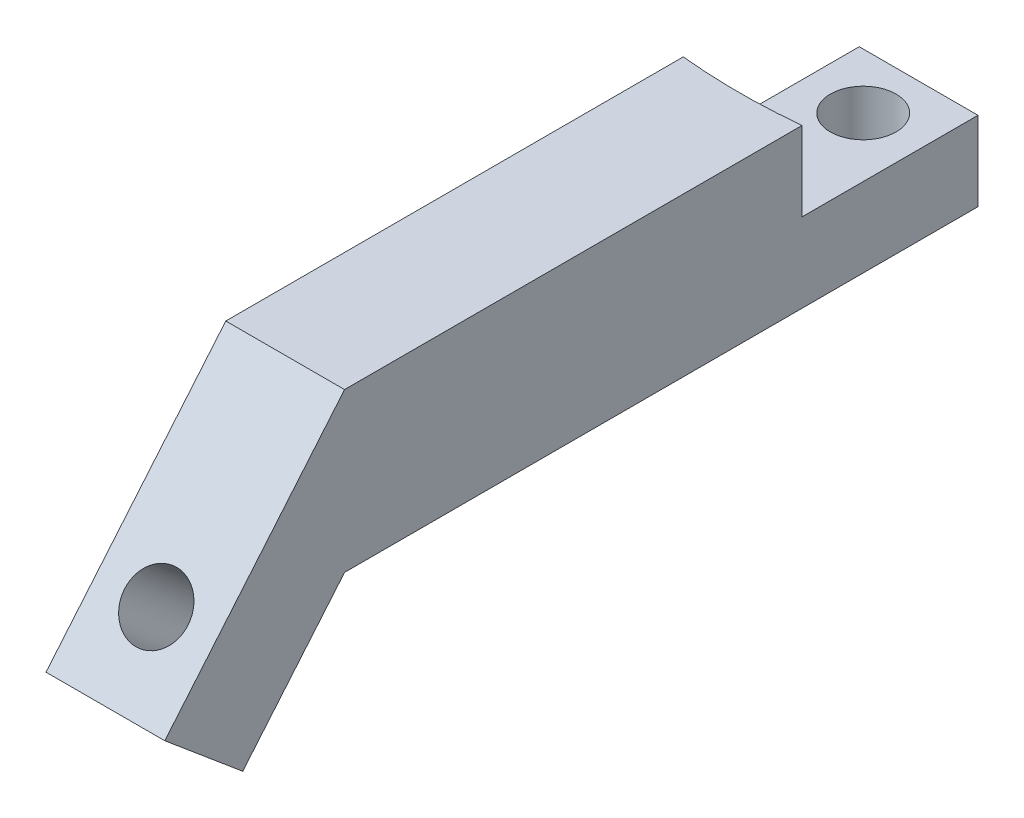
ISO-10303-21;
HEADER;
FILE_DESCRIPTION(('STEP AP214'),'2;1');
FILE_NAME('part.step','',(''),(''),'','','');
FILE_SCHEMA(('AUTOMOTIVE_DESIGN { 1 0 10303 214 1 1 1 1 }'));
ENDSEC;
DATA;
#1=APPLICATION_CONTEXT('core data for automotive mechanical design processes');
#2=APPLICATION_PROTOCOL_DEFINITION('international standard','automotive_design',2000,#1);
#3=PRODUCT_CONTEXT('',#1,'mechanical');
#4=PRODUCT('Part','Part','',(#3));
#5=PRODUCT_RELATED_PRODUCT_CATEGORY('part','',(#4));
#6=PRODUCT_DEFINITION_FORMATION('','',#4);
#7=PRODUCT_DEFINITION_CONTEXT('part definition',#1,'design');
#8=PRODUCT_DEFINITION('design','',#6,#7);
#9=PRODUCT_DEFINITION_SHAPE('','',#8);
#10=(LENGTH_UNIT() NAMED_UNIT(*) SI_UNIT(.MILLI.,.METRE.));
#11=(NAMED_UNIT(*) PLANE_ANGLE_UNIT() SI_UNIT($,.RADIAN.));
#12=(NAMED_UNIT(*) SI_UNIT($,.STERADIAN.) SOLID_ANGLE_UNIT());
#13=UNCERTAINTY_MEASURE_WITH_UNIT(LENGTH_MEASURE(1.E-05),#10,'distance_accuracy_value','');
#14=(GEOMETRIC_REPRESENTATION_CONTEXT(3) GLOBAL_UNCERTAINTY_ASSIGNED_CONTEXT((#13)) GLOBAL_UNIT_ASSIGNED_CONTEXT((#10,
#11,#12)) REPRESENTATION_CONTEXT('',''));
#15=CARTESIAN_POINT('',(0.,0.,0.));
#16=DIRECTION('',(0.,0.,1.));
#17=DIRECTION('',(1.,0.,0.));
#18=AXIS2_PLACEMENT_3D('',#15,#16,#17);
#19=CARTESIAN_POINT('',(0.,10.,0.));
#20=DIRECTION('',(0.,1.,0.));
#21=DIRECTION('',(0.,0.,1.));
#22=AXIS2_PLACEMENT_3D('',#19,#20,#21);
#23=PLANE('',#22);
#24=CARTESIAN_POINT('',(0.,10.,-33.));
#25=DIRECTION('',(0.,1.,0.));
#26=DIRECTION('',(0.,0.,1.));
#27=AXIS2_PLACEMENT_3D('',#24,#25,#26);
#28=CIRCLE('',#27,4.15);
#29=CARTESIAN_POINT('',(0.,10.,-28.85));
#30=VERTEX_POINT('',#29);
#31=EDGE_CURVE('E94',#30,#30,#28,.T.);
#32=ORIENTED_EDGE('',*,*,#31,.F.);
#33=EDGE_LOOP('',(#32));
#34=FACE_BOUND('',#33,.T.);
#35=CARTESIAN_POINT('',(0.,10.,-92.4));
#36=DIRECTION('',(0.,-1.,0.));
#37=DIRECTION('',(0.,0.,-1.));
#38=AXIS2_PLACEMENT_3D('',#35,#36,#37);
#39=CIRCLE('',#38,75.);
#40=CARTESIAN_POINT('',(7.5,10.,-17.7759422170035));
#41=VERTEX_POINT('',#40);
#42=CARTESIAN_POINT('',(-7.5,10.,-17.7759422170035));
#43=VERTEX_POINT('',#42);
#44=EDGE_CURVE('E50',#41,#43,#39,.T.);
#45=ORIENTED_EDGE('',*,*,#44,.F.);
#46=DIRECTION('',(0.,0.,-1.));
#47=VECTOR('',#46,1.);
#48=CARTESIAN_POINT('',(7.50000000000001,10.,40.));
#49=LINE('',#48,#47);
#50=CARTESIAN_POINT('',(7.5,10.,-40.));
#51=VERTEX_POINT('',#50);
#52=EDGE_CURVE('E159',#41,#51,#49,.T.);
#53=ORIENTED_EDGE('',*,*,#52,.T.);
#54=DIRECTION('',(-1.,0.,0.));
#55=VECTOR('',#54,1.);
#56=CARTESIAN_POINT('',(7.5,10.,-40.));
#57=LINE('',#56,#55);
#58=CARTESIAN_POINT('',(-7.5,10.,-40.));
#59=VERTEX_POINT('',#58);
#60=EDGE_CURVE('E56',#51,#59,#57,.T.);
#61=ORIENTED_EDGE('',*,*,#60,.T.);
#62=DIRECTION('',(0.,0.,1.));
#63=VECTOR('',#62,1.);
#64=CARTESIAN_POINT('',(-7.49999999999999,10.,40.));
#65=LINE('',#64,#63);
#66=EDGE_CURVE('E78',#59,#43,#65,.T.);
#67=ORIENTED_EDGE('',*,*,#66,.T.);
#68=EDGE_LOOP('',(#45,#53,#61,#67));
#69=FACE_BOUND('',#68,.T.);
#70=ADVANCED_FACE('F34',(#34,#69),#23,.T.);
#71=CARTESIAN_POINT('',(0.,0.,0.));
#72=DIRECTION('',(0.,1.,0.));
#73=DIRECTION('',(0.,0.,1.));
#74=AXIS2_PLACEMENT_3D('',#71,#72,#73);
#75=PLANE('',#74);
#76=DIRECTION('',(0.,0.,1.));
#77=VECTOR('',#76,1.);
#78=CARTESIAN_POINT('',(-7.49999999999999,0.,40.));
#79=LINE('',#78,#77);
#80=CARTESIAN_POINT('',(-7.5,0.,-40.));
#81=VERTEX_POINT('',#80);
#82=CARTESIAN_POINT('',(-7.49999999999999,0.,40.));
#83=VERTEX_POINT('',#82);
#84=EDGE_CURVE('E85',#81,#83,#79,.T.);
#85=ORIENTED_EDGE('',*,*,#84,.F.);
#86=DIRECTION('',(-1.,0.,0.));
#87=VECTOR('',#86,1.);
#88=CARTESIAN_POINT('',(7.5,0.,-40.));
#89=LINE('',#88,#87);
#90=CARTESIAN_POINT('',(7.5,0.,-40.));
#91=VERTEX_POINT('',#90);
#92=EDGE_CURVE('E71',#91,#81,#89,.T.);
#93=ORIENTED_EDGE('',*,*,#92,.F.);
#94=DIRECTION('',(0.,0.,-1.));
#95=VECTOR('',#94,1.);
#96=CARTESIAN_POINT('',(7.50000000000001,0.,40.));
#97=LINE('',#96,#95);
#98=CARTESIAN_POINT('',(7.50000000000001,0.,40.));
#99=VERTEX_POINT('',#98);
#100=EDGE_CURVE('E79',#99,#91,#97,.T.);
#101=ORIENTED_EDGE('',*,*,#100,.F.);
#102=DIRECTION('',(1.,0.,0.));
#103=VECTOR('',#102,1.);
#104=CARTESIAN_POINT('',(7.50000000000001,0.,40.));
#105=LINE('',#104,#103);
#106=EDGE_CURVE('E92',#83,#99,#105,.T.);
#107=ORIENTED_EDGE('',*,*,#106,.F.);
#108=EDGE_LOOP('',(#85,#93,#101,#107));
#109=FACE_BOUND('',#108,.T.);
#110=CARTESIAN_POINT('',(0.,0.,-33.));
#111=DIRECTION('',(0.,1.,0.));
#112=DIRECTION('',(0.,0.,1.));
#113=AXIS2_PLACEMENT_3D('',#110,#111,#112);
#114=CIRCLE('',#113,4.15);
#115=CARTESIAN_POINT('',(0.,0.,-28.85));
#116=VERTEX_POINT('',#115);
#117=EDGE_CURVE('E98',#116,#116,#114,.T.);
#118=ORIENTED_EDGE('',*,*,#117,.T.);
#119=EDGE_LOOP('',(#118));
#120=FACE_BOUND('',#119,.T.);
#121=ADVANCED_FACE('F89',(#109,#120),#75,.F.);
#122=CARTESIAN_POINT('',(-7.49999999999999,10.,40.));
#123=DIRECTION('',(1.,0.,0.));
#124=DIRECTION('',(0.,0.,-1.));
#125=AXIS2_PLACEMENT_3D('',#122,#123,#124);
#126=PLANE('',#125);
#127=ORIENTED_EDGE('',*,*,#84,.T.);
#128=DIRECTION('',(0.,-0.766044443118975,0.642787609686543));
#129=VECTOR('',#128,1.);
#130=CARTESIAN_POINT('',(-7.49999999999999,0.,40.));
#131=LINE('',#130,#129);
#132=CARTESIAN_POINT('',(-7.49999999999999,-15.3208888623795,52.8557521937309));
#133=VERTEX_POINT('',#132);
#134=EDGE_CURVE('E113',#83,#133,#131,.T.);
#135=ORIENTED_EDGE('',*,*,#134,.T.);
#136=DIRECTION('',(0.,0.642787609686543,0.766044443118975));
#137=VECTOR('',#136,1.);
#138=CARTESIAN_POINT('',(-7.49999999999999,-15.3208888623795,52.8557521937309));
#139=LINE('',#138,#137);
#140=CARTESIAN_POINT('',(-7.49999999999999,-7.05737063904871,62.703829723853));
#141=VERTEX_POINT('',#140);
#142=EDGE_CURVE('E122',#133,#141,#139,.T.);
#143=ORIENTED_EDGE('',*,*,#142,.T.);
#144=DIRECTION('',(0.,0.766044443118975,-0.642787609686543));
#145=VECTOR('',#144,1.);
#146=CARTESIAN_POINT('',(-7.49999999999999,-7.05737063904871,62.703829723853));
#147=LINE('',#146,#145);
#148=CARTESIAN_POINT('',(-7.49999999999999,20.,40.));
#149=VERTEX_POINT('',#148);
#150=EDGE_CURVE('E121',#141,#149,#147,.T.);
#151=ORIENTED_EDGE('',*,*,#150,.T.);
#152=DIRECTION('',(0.,0.,1.));
#153=VECTOR('',#152,1.);
#154=CARTESIAN_POINT('',(-7.49999999999999,20.,40.));
#155=LINE('',#154,#153);
#156=CARTESIAN_POINT('',(-7.5,20.,-17.7759422170035));
#157=VERTEX_POINT('',#156);
#158=EDGE_CURVE('E142',#157,#149,#155,.T.);
#159=ORIENTED_EDGE('',*,*,#158,.F.);
#160=DIRECTION('',(0.,-1.,0.));
#161=VECTOR('',#160,1.);
#162=CARTESIAN_POINT('',(-7.5,20.,-17.7759422170035));
#163=LINE('',#162,#161);
#164=EDGE_CURVE('E155',#157,#43,#163,.T.);
#165=ORIENTED_EDGE('',*,*,#164,.T.);
#166=ORIENTED_EDGE('',*,*,#66,.F.);
#167=DIRECTION('',(0.,-1.,0.));
#168=VECTOR('',#167,1.);
#169=CARTESIAN_POINT('',(-7.5,10.,-40.));
#170=LINE('',#169,#168);
#171=EDGE_CURVE('E43',#59,#81,#170,.T.);
#172=ORIENTED_EDGE('',*,*,#171,.T.);
#173=EDGE_LOOP('',(#127,#135,#143,#151,#159,#165,#166,#172));
#174=FACE_BOUND('',#173,.T.);
#175=ADVANCED_FACE('F36',(#174),#126,.F.);
#176=CARTESIAN_POINT('',(7.50000000000001,10.,40.));
#177=DIRECTION('',(-1.,0.,0.));
#178=DIRECTION('',(0.,0.,1.));
#179=AXIS2_PLACEMENT_3D('',#176,#177,#178);
#180=PLANE('',#179);
#181=ORIENTED_EDGE('',*,*,#100,.T.);
#182=DIRECTION('',(0.,-1.,0.));
#183=VECTOR('',#182,1.);
#184=CARTESIAN_POINT('',(7.5,10.,-40.));
#185=LINE('',#184,#183);
#186=EDGE_CURVE('E11',#51,#91,#185,.T.);
#187=ORIENTED_EDGE('',*,*,#186,.F.);
#188=ORIENTED_EDGE('',*,*,#52,.F.);
#189=DIRECTION('',(0.,-1.,0.));
#190=VECTOR('',#189,1.);
#191=CARTESIAN_POINT('',(7.50000000000001,20.,-17.7759422170035));
#192=LINE('',#191,#190);
#193=CARTESIAN_POINT('',(7.50000000000001,20.,-17.7759422170035));
#194=VERTEX_POINT('',#193);
#195=EDGE_CURVE('E151',#194,#41,#192,.T.);
#196=ORIENTED_EDGE('',*,*,#195,.F.);
#197=DIRECTION('',(0.,0.,-1.));
#198=VECTOR('',#197,1.);
#199=CARTESIAN_POINT('',(7.50000000000001,20.,-17.7759422170035));
#200=LINE('',#199,#198);
#201=CARTESIAN_POINT('',(7.50000000000001,20.,40.));
#202=VERTEX_POINT('',#201);
#203=EDGE_CURVE('E148',#202,#194,#200,.T.);
#204=ORIENTED_EDGE('',*,*,#203,.F.);
#205=DIRECTION('',(0.,-0.766044443118975,0.642787609686543));
#206=VECTOR('',#205,1.);
#207=CARTESIAN_POINT('',(7.50000000000002,-7.05737063904871,62.703829723853));
#208=LINE('',#207,#206);
#209=CARTESIAN_POINT('',(7.50000000000002,-7.05737063904871,62.703829723853));
#210=VERTEX_POINT('',#209);
#211=EDGE_CURVE('E129',#202,#210,#208,.T.);
#212=ORIENTED_EDGE('',*,*,#211,.T.);
#213=DIRECTION('',(0.,-0.642787609686543,-0.766044443118975));
#214=VECTOR('',#213,1.);
#215=CARTESIAN_POINT('',(7.50000000000001,-15.3208888623795,52.8557521937309));
#216=LINE('',#215,#214);
#217=CARTESIAN_POINT('',(7.50000000000001,-15.3208888623795,52.8557521937309));
#218=VERTEX_POINT('',#217);
#219=EDGE_CURVE('E132',#210,#218,#216,.T.);
#220=ORIENTED_EDGE('',*,*,#219,.T.);
#221=DIRECTION('',(0.,0.766044443118975,-0.642787609686543));
#222=VECTOR('',#221,1.);
#223=CARTESIAN_POINT('',(7.50000000000001,0.,40.));
#224=LINE('',#223,#222);
#225=EDGE_CURVE('E108',#218,#99,#224,.T.);
#226=ORIENTED_EDGE('',*,*,#225,.T.);
#227=EDGE_LOOP('',(#181,#187,#188,#196,#204,#212,#220,#226));
#228=FACE_BOUND('',#227,.T.);
#229=ADVANCED_FACE('F105',(#228),#180,.F.);
#230=CARTESIAN_POINT('',(7.5,10.,-40.));
#231=DIRECTION('',(0.,0.,1.));
#232=DIRECTION('',(1.,0.,0.));
#233=AXIS2_PLACEMENT_3D('',#230,#231,#232);
#234=PLANE('',#233);
#235=ORIENTED_EDGE('',*,*,#92,.T.);
#236=ORIENTED_EDGE('',*,*,#171,.F.);
#237=ORIENTED_EDGE('',*,*,#60,.F.);
#238=ORIENTED_EDGE('',*,*,#186,.T.);
#239=EDGE_LOOP('',(#235,#236,#237,#238));
#240=FACE_BOUND('',#239,.T.);
#241=ADVANCED_FACE('F73',(#240),#234,.F.);
#242=CARTESIAN_POINT('',(0.,10.,-33.));
#243=DIRECTION('',(0.,-1.,0.));
#244=DIRECTION('',(0.,0.,-1.));
#245=AXIS2_PLACEMENT_3D('',#242,#243,#244);
#246=CYLINDRICAL_SURFACE('',#245,4.15);
#247=ORIENTED_EDGE('',*,*,#31,.T.);
#248=EDGE_LOOP('',(#247));
#249=FACE_BOUND('',#248,.T.);
#250=ORIENTED_EDGE('',*,*,#117,.F.);
#251=EDGE_LOOP('',(#250));
#252=FACE_BOUND('',#251,.T.);
#253=ADVANCED_FACE('F211',(#249,#252),#246,.F.);
#254=CARTESIAN_POINT('',(0.,20.,-92.4));
#255=DIRECTION('',(0.,-1.,0.));
#256=DIRECTION('',(0.,0.,-1.));
#257=AXIS2_PLACEMENT_3D('',#254,#255,#256);
#258=CYLINDRICAL_SURFACE('',#257,75.);
#259=ORIENTED_EDGE('',*,*,#44,.T.);
#260=ORIENTED_EDGE('',*,*,#164,.F.);
#261=CARTESIAN_POINT('',(0.,20.,-92.4));
#262=DIRECTION('',(0.,-1.,0.));
#263=DIRECTION('',(0.,0.,-1.));
#264=AXIS2_PLACEMENT_3D('',#261,#262,#263);
#265=CIRCLE('',#264,75.);
#266=EDGE_CURVE('E139',#194,#157,#265,.T.);
#267=ORIENTED_EDGE('',*,*,#266,.F.);
#268=ORIENTED_EDGE('',*,*,#195,.T.);
#269=EDGE_LOOP('',(#259,#260,#267,#268));
#270=FACE_BOUND('',#269,.T.);
#271=ADVANCED_FACE('F164',(#270),#258,.F.);
#272=CARTESIAN_POINT('',(0.,20.,-92.4));
#273=DIRECTION('',(0.,-1.,0.));
#274=DIRECTION('',(0.,0.,-1.));
#275=AXIS2_PLACEMENT_3D('',#272,#273,#274);
#276=PLANE('',#275);
#277=ORIENTED_EDGE('',*,*,#266,.T.);
#278=ORIENTED_EDGE('',*,*,#158,.T.);
#279=DIRECTION('',(1.,0.,0.));
#280=VECTOR('',#279,1.);
#281=CARTESIAN_POINT('',(7.50000000000001,20.,40.));
#282=LINE('',#281,#280);
#283=EDGE_CURVE('E145',#149,#202,#282,.T.);
#284=ORIENTED_EDGE('',*,*,#283,.T.);
#285=ORIENTED_EDGE('',*,*,#203,.T.);
#286=EDGE_LOOP('',(#277,#278,#284,#285));
#287=FACE_BOUND('',#286,.T.);
#288=ADVANCED_FACE('F171',(#287),#276,.F.);
#289=CARTESIAN_POINT('',(-49.488439768087,0.,40.));
#290=DIRECTION('',(0.,-0.642787609686543,-0.766044443118975));
#291=DIRECTION('',(0.,0.766044443118975,-0.642787609686543));
#292=AXIS2_PLACEMENT_3D('',#289,#290,#291);
#293=PLANE('',#292);
#294=CARTESIAN_POINT('',(0.,-7.66044443118975,46.4278760968655));
#295=DIRECTION('',(0.,-0.642787609686543,-0.766044443118975));
#296=DIRECTION('',(0.,0.766044443118975,-0.642787609686543));
#297=AXIS2_PLACEMENT_3D('',#294,#295,#296);
#298=CIRCLE('',#297,4.);
#299=CARTESIAN_POINT('',(0.,-4.59626665871385,43.8567256581193));
#300=VERTEX_POINT('',#299);
#301=EDGE_CURVE('E306',#300,#300,#298,.T.);
#302=ORIENTED_EDGE('',*,*,#301,.F.);
#303=EDGE_LOOP('',(#302));
#304=FACE_BOUND('',#303,.T.);
#305=ORIENTED_EDGE('',*,*,#134,.F.);
#306=ORIENTED_EDGE('',*,*,#106,.T.);
#307=ORIENTED_EDGE('',*,*,#225,.F.);
#308=DIRECTION('',(1.,0.,0.));
#309=VECTOR('',#308,1.);
#310=CARTESIAN_POINT('',(-49.488439768087,-15.3208888623795,52.8557521937309));
#311=LINE('',#310,#309);
#312=EDGE_CURVE('E116',#133,#218,#311,.T.);
#313=ORIENTED_EDGE('',*,*,#312,.F.);
#314=EDGE_LOOP('',(#305,#306,#307,#313));
#315=FACE_BOUND('',#314,.T.);
#316=ADVANCED_FACE('F110',(#304,#315),#293,.T.);
#317=CARTESIAN_POINT('',(-49.488439768087,-15.3208888623795,52.8557521937309));
#318=DIRECTION('',(0.,-0.766044443118975,0.642787609686543));
#319=DIRECTION('',(0.,-0.642787609686543,-0.766044443118975));
#320=AXIS2_PLACEMENT_3D('',#317,#318,#319);
#321=PLANE('',#320);
#322=ORIENTED_EDGE('',*,*,#142,.F.);
#323=ORIENTED_EDGE('',*,*,#312,.T.);
#324=ORIENTED_EDGE('',*,*,#219,.F.);
#325=DIRECTION('',(1.,0.,0.));
#326=VECTOR('',#325,1.);
#327=CARTESIAN_POINT('',(-49.488439768087,-7.05737063904871,62.703829723853));
#328=LINE('',#327,#326);
#329=EDGE_CURVE('E135',#141,#210,#328,.T.);
#330=ORIENTED_EDGE('',*,*,#329,.F.);
#331=EDGE_LOOP('',(#322,#323,#324,#330));
#332=FACE_BOUND('',#331,.T.);
#333=ADVANCED_FACE('F188',(#332),#321,.T.);
#334=CARTESIAN_POINT('',(-49.488439768087,-7.05737063904871,62.703829723853));
#335=DIRECTION('',(0.,0.642787609686543,0.766044443118975));
#336=DIRECTION('',(0.,-0.766044443118975,0.642787609686543));
#337=AXIS2_PLACEMENT_3D('',#334,#335,#336);
#338=PLANE('',#337);
#339=CARTESIAN_POINT('',(0.,0.603073792141036,56.2759536269875));
#340=DIRECTION('',(0.,0.642787609686543,0.766044443118975));
#341=DIRECTION('',(0.,-0.766044443118975,0.642787609686543));
#342=AXIS2_PLACEMENT_3D('',#339,#340,#341);
#343=CIRCLE('',#342,4.);
#344=CARTESIAN_POINT('',(0.,-2.46110398033487,58.8471040657337));
#345=VERTEX_POINT('',#344);
#346=EDGE_CURVE('E38',#345,#345,#343,.T.);
#347=ORIENTED_EDGE('',*,*,#346,.F.);
#348=EDGE_LOOP('',(#347));
#349=FACE_BOUND('',#348,.T.);
#350=ORIENTED_EDGE('',*,*,#150,.F.);
#351=ORIENTED_EDGE('',*,*,#329,.T.);
#352=ORIENTED_EDGE('',*,*,#211,.F.);
#353=ORIENTED_EDGE('',*,*,#283,.F.);
#354=EDGE_LOOP('',(#350,#351,#352,#353));
#355=FACE_BOUND('',#354,.T.);
#356=ADVANCED_FACE('F183',(#349,#355),#338,.T.);
#357=CARTESIAN_POINT('',(0.,11.7825275597008,69.5991078177176));
#358=DIRECTION('',(0.,-0.642787609686543,-0.766044443118975));
#359=DIRECTION('',(0.,0.766044443118975,-0.642787609686543));
#360=AXIS2_PLACEMENT_3D('',#357,#358,#359);
#361=CYLINDRICAL_SURFACE('',#360,4.);
#362=ORIENTED_EDGE('',*,*,#346,.T.);
#363=EDGE_LOOP('',(#362));
#364=FACE_BOUND('',#363,.T.);
#365=ORIENTED_EDGE('',*,*,#301,.T.);
#366=EDGE_LOOP('',(#365));
#367=FACE_BOUND('',#366,.T.);
#368=ADVANCED_FACE('F197',(#364,#367),#361,.F.);
#369=CLOSED_SHELL('',(#70,#121,#175,#229,#241,#253,#271,#288,#316,#333,#356,#368));
#370=MANIFOLD_SOLID_BREP('B2',#369);
#371=ADVANCED_BREP_SHAPE_REPRESENTATION('',(#18,#370),#14);
#372=SHAPE_DEFINITION_REPRESENTATION(#9,#371);
ENDSEC;
END-ISO-10303-21;
